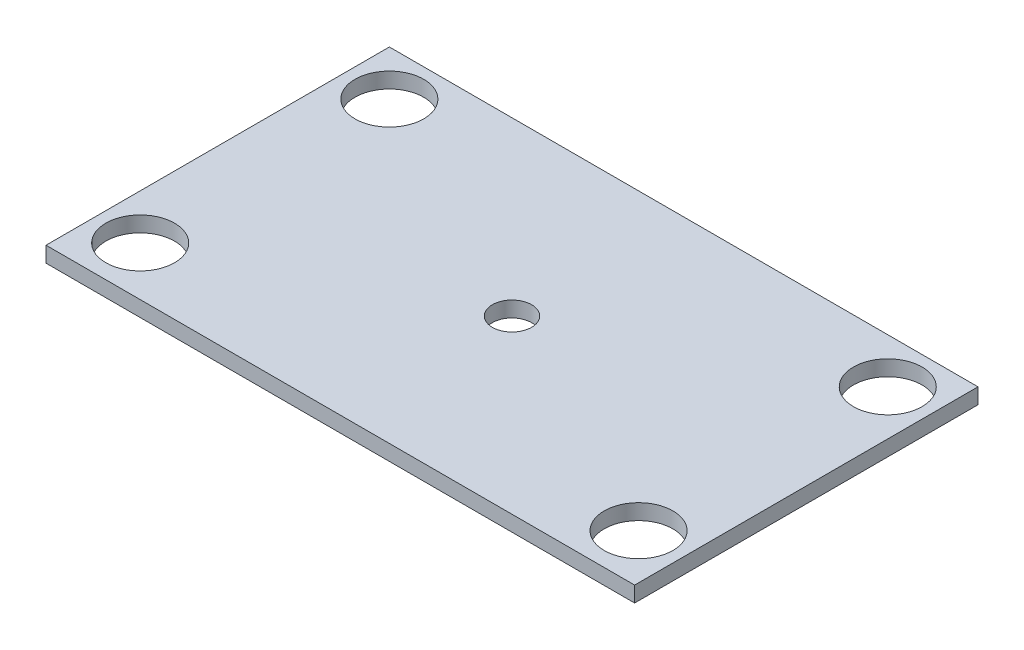
ISO-10303-21;
HEADER;
FILE_DESCRIPTION(('STEP AP214'),'2;1');
FILE_NAME('part.step','',(''),(''),'','','');
FILE_SCHEMA(('AUTOMOTIVE_DESIGN { 1 0 10303 214 1 1 1 1 }'));
ENDSEC;
DATA;
#1=APPLICATION_CONTEXT('core data for automotive mechanical design processes');
#2=APPLICATION_PROTOCOL_DEFINITION('international standard','automotive_design',2000,#1);
#3=PRODUCT_CONTEXT('',#1,'mechanical');
#4=PRODUCT('Part','Part','',(#3));
#5=PRODUCT_RELATED_PRODUCT_CATEGORY('part','',(#4));
#6=PRODUCT_DEFINITION_FORMATION('','',#4);
#7=PRODUCT_DEFINITION_CONTEXT('part definition',#1,'design');
#8=PRODUCT_DEFINITION('design','',#6,#7);
#9=PRODUCT_DEFINITION_SHAPE('','',#8);
#10=(LENGTH_UNIT() NAMED_UNIT(*) SI_UNIT(.MILLI.,.METRE.));
#11=(NAMED_UNIT(*) PLANE_ANGLE_UNIT() SI_UNIT($,.RADIAN.));
#12=(NAMED_UNIT(*) SI_UNIT($,.STERADIAN.) SOLID_ANGLE_UNIT());
#13=UNCERTAINTY_MEASURE_WITH_UNIT(LENGTH_MEASURE(1.E-05),#10,'distance_accuracy_value','');
#14=(GEOMETRIC_REPRESENTATION_CONTEXT(3) GLOBAL_UNCERTAINTY_ASSIGNED_CONTEXT((#13)) GLOBAL_UNIT_ASSIGNED_CONTEXT((#10,
#11,#12)) REPRESENTATION_CONTEXT('',''));
#15=CARTESIAN_POINT('',(0.,0.,0.));
#16=DIRECTION('',(0.,0.,1.));
#17=DIRECTION('',(1.,0.,0.));
#18=AXIS2_PLACEMENT_3D('',#15,#16,#17);
#19=CARTESIAN_POINT('',(0.,1.5875,0.));
#20=DIRECTION('',(0.,-1.,0.));
#21=DIRECTION('',(0.,0.,-1.));
#22=AXIS2_PLACEMENT_3D('',#19,#20,#21);
#23=PLANE('',#22);
#24=DIRECTION('',(0.,0.,1.));
#25=VECTOR('',#24,1.);
#26=CARTESIAN_POINT('',(0.,1.5875,0.));
#27=LINE('',#26,#25);
#28=CARTESIAN_POINT('',(0.,1.5875,-35.));
#29=VERTEX_POINT('',#28);
#30=CARTESIAN_POINT('',(0.,1.5875,0.));
#31=VERTEX_POINT('',#30);
#32=EDGE_CURVE('E96',#29,#31,#27,.T.);
#33=ORIENTED_EDGE('',*,*,#32,.T.);
#34=DIRECTION('',(1.,0.,0.));
#35=VECTOR('',#34,1.);
#36=CARTESIAN_POINT('',(0.,1.5875,0.));
#37=LINE('',#36,#35);
#38=CARTESIAN_POINT('',(60.,1.5875,0.));
#39=VERTEX_POINT('',#38);
#40=EDGE_CURVE('E91',#31,#39,#37,.T.);
#41=ORIENTED_EDGE('',*,*,#40,.T.);
#42=DIRECTION('',(0.,0.,-1.));
#43=VECTOR('',#42,1.);
#44=CARTESIAN_POINT('',(60.,1.5875,0.));
#45=LINE('',#44,#43);
#46=CARTESIAN_POINT('',(60.,1.5875,-35.));
#47=VERTEX_POINT('',#46);
#48=EDGE_CURVE('E94',#39,#47,#45,.T.);
#49=ORIENTED_EDGE('',*,*,#48,.T.);
#50=DIRECTION('',(-1.,0.,0.));
#51=VECTOR('',#50,1.);
#52=CARTESIAN_POINT('',(0.,1.5875,-35.));
#53=LINE('',#52,#51);
#54=EDGE_CURVE('E61',#47,#29,#53,.T.);
#55=ORIENTED_EDGE('',*,*,#54,.T.);
#56=EDGE_LOOP('',(#33,#41,#49,#55));
#57=FACE_BOUND('',#56,.T.);
#58=CARTESIAN_POINT('',(4.6,1.5875,-30.4));
#59=DIRECTION('',(0.,1.,0.));
#60=DIRECTION('',(0.,0.,1.));
#61=AXIS2_PLACEMENT_3D('',#58,#59,#60);
#62=CIRCLE('',#61,3.5);
#63=CARTESIAN_POINT('',(4.6,1.5875,-26.9));
#64=VERTEX_POINT('',#63);
#65=EDGE_CURVE('E116',#64,#64,#62,.T.);
#66=ORIENTED_EDGE('',*,*,#65,.F.);
#67=EDGE_LOOP('',(#66));
#68=FACE_BOUND('',#67,.T.);
#69=CARTESIAN_POINT('',(55.4,1.5875,-30.4));
#70=DIRECTION('',(0.,1.,0.));
#71=DIRECTION('',(0.,0.,1.));
#72=AXIS2_PLACEMENT_3D('',#69,#70,#71);
#73=CIRCLE('',#72,3.5);
#74=CARTESIAN_POINT('',(55.4,1.5875,-26.9));
#75=VERTEX_POINT('',#74);
#76=EDGE_CURVE('E138',#75,#75,#73,.T.);
#77=ORIENTED_EDGE('',*,*,#76,.F.);
#78=EDGE_LOOP('',(#77));
#79=FACE_BOUND('',#78,.T.);
#80=CARTESIAN_POINT('',(4.6,1.5875,-5.));
#81=DIRECTION('',(0.,1.,0.));
#82=DIRECTION('',(0.,0.,1.));
#83=AXIS2_PLACEMENT_3D('',#80,#81,#82);
#84=CIRCLE('',#83,3.5);
#85=CARTESIAN_POINT('',(4.6,1.5875,-1.5));
#86=VERTEX_POINT('',#85);
#87=EDGE_CURVE('E146',#86,#86,#84,.T.);
#88=ORIENTED_EDGE('',*,*,#87,.F.);
#89=EDGE_LOOP('',(#88));
#90=FACE_BOUND('',#89,.T.);
#91=CARTESIAN_POINT('',(55.4,1.5875,-5.));
#92=DIRECTION('',(0.,1.,0.));
#93=DIRECTION('',(0.,0.,1.));
#94=AXIS2_PLACEMENT_3D('',#91,#92,#93);
#95=CIRCLE('',#94,3.5);
#96=CARTESIAN_POINT('',(55.4,1.5875,-1.5));
#97=VERTEX_POINT('',#96);
#98=EDGE_CURVE('E154',#97,#97,#95,.T.);
#99=ORIENTED_EDGE('',*,*,#98,.F.);
#100=EDGE_LOOP('',(#99));
#101=FACE_BOUND('',#100,.T.);
#102=CARTESIAN_POINT('',(30.,1.5875,-17.5));
#103=DIRECTION('',(0.,1.,0.));
#104=DIRECTION('',(0.,0.,1.));
#105=AXIS2_PLACEMENT_3D('',#102,#103,#104);
#106=CIRCLE('',#105,2.);
#107=CARTESIAN_POINT('',(30.,1.5875,-15.5));
#108=VERTEX_POINT('',#107);
#109=EDGE_CURVE('E162',#108,#108,#106,.T.);
#110=ORIENTED_EDGE('',*,*,#109,.F.);
#111=EDGE_LOOP('',(#110));
#112=FACE_BOUND('',#111,.T.);
#113=ADVANCED_FACE('F43',(#57,#68,#79,#90,#101,#112),#23,.F.);
#114=CARTESIAN_POINT('',(0.,0.,0.));
#115=DIRECTION('',(0.,-1.,0.));
#116=DIRECTION('',(0.,0.,-1.));
#117=AXIS2_PLACEMENT_3D('',#114,#115,#116);
#118=PLANE('',#117);
#119=CARTESIAN_POINT('',(55.4,0.,-5.));
#120=DIRECTION('',(0.,1.,0.));
#121=DIRECTION('',(0.,0.,1.));
#122=AXIS2_PLACEMENT_3D('',#119,#120,#121);
#123=CIRCLE('',#122,3.5);
#124=CARTESIAN_POINT('',(55.4,0.,-1.5));
#125=VERTEX_POINT('',#124);
#126=EDGE_CURVE('E158',#125,#125,#123,.T.);
#127=ORIENTED_EDGE('',*,*,#126,.T.);
#128=EDGE_LOOP('',(#127));
#129=FACE_BOUND('',#128,.T.);
#130=CARTESIAN_POINT('',(55.4,0.,-30.4));
#131=DIRECTION('',(0.,1.,0.));
#132=DIRECTION('',(0.,0.,1.));
#133=AXIS2_PLACEMENT_3D('',#130,#131,#132);
#134=CIRCLE('',#133,3.5);
#135=CARTESIAN_POINT('',(55.4,0.,-26.9));
#136=VERTEX_POINT('',#135);
#137=EDGE_CURVE('E142',#136,#136,#134,.T.);
#138=ORIENTED_EDGE('',*,*,#137,.T.);
#139=EDGE_LOOP('',(#138));
#140=FACE_BOUND('',#139,.T.);
#141=DIRECTION('',(0.,0.,1.));
#142=VECTOR('',#141,1.);
#143=CARTESIAN_POINT('',(0.,0.,0.));
#144=LINE('',#143,#142);
#145=CARTESIAN_POINT('',(0.,0.,-35.));
#146=VERTEX_POINT('',#145);
#147=CARTESIAN_POINT('',(0.,0.,0.));
#148=VERTEX_POINT('',#147);
#149=EDGE_CURVE('E112',#146,#148,#144,.T.);
#150=ORIENTED_EDGE('',*,*,#149,.F.);
#151=DIRECTION('',(-1.,0.,0.));
#152=VECTOR('',#151,1.);
#153=CARTESIAN_POINT('',(0.,0.,-35.));
#154=LINE('',#153,#152);
#155=CARTESIAN_POINT('',(60.,0.,-35.));
#156=VERTEX_POINT('',#155);
#157=EDGE_CURVE('E84',#156,#146,#154,.T.);
#158=ORIENTED_EDGE('',*,*,#157,.F.);
#159=DIRECTION('',(0.,0.,-1.));
#160=VECTOR('',#159,1.);
#161=CARTESIAN_POINT('',(60.,0.,0.));
#162=LINE('',#161,#160);
#163=CARTESIAN_POINT('',(60.,0.,0.));
#164=VERTEX_POINT('',#163);
#165=EDGE_CURVE('E78',#164,#156,#162,.T.);
#166=ORIENTED_EDGE('',*,*,#165,.F.);
#167=DIRECTION('',(1.,0.,0.));
#168=VECTOR('',#167,1.);
#169=CARTESIAN_POINT('',(0.,0.,0.));
#170=LINE('',#169,#168);
#171=EDGE_CURVE('E101',#148,#164,#170,.T.);
#172=ORIENTED_EDGE('',*,*,#171,.F.);
#173=EDGE_LOOP('',(#150,#158,#166,#172));
#174=FACE_BOUND('',#173,.T.);
#175=CARTESIAN_POINT('',(4.6,0.,-30.4));
#176=DIRECTION('',(0.,1.,0.));
#177=DIRECTION('',(0.,0.,1.));
#178=AXIS2_PLACEMENT_3D('',#175,#176,#177);
#179=CIRCLE('',#178,3.5);
#180=CARTESIAN_POINT('',(4.6,0.,-26.9));
#181=VERTEX_POINT('',#180);
#182=EDGE_CURVE('E134',#181,#181,#179,.T.);
#183=ORIENTED_EDGE('',*,*,#182,.T.);
#184=EDGE_LOOP('',(#183));
#185=FACE_BOUND('',#184,.T.);
#186=CARTESIAN_POINT('',(4.6,0.,-5.));
#187=DIRECTION('',(0.,1.,0.));
#188=DIRECTION('',(0.,0.,1.));
#189=AXIS2_PLACEMENT_3D('',#186,#187,#188);
#190=CIRCLE('',#189,3.5);
#191=CARTESIAN_POINT('',(4.6,0.,-1.5));
#192=VERTEX_POINT('',#191);
#193=EDGE_CURVE('E150',#192,#192,#190,.T.);
#194=ORIENTED_EDGE('',*,*,#193,.T.);
#195=EDGE_LOOP('',(#194));
#196=FACE_BOUND('',#195,.T.);
#197=CARTESIAN_POINT('',(30.,0.,-17.5));
#198=DIRECTION('',(0.,1.,0.));
#199=DIRECTION('',(0.,0.,1.));
#200=AXIS2_PLACEMENT_3D('',#197,#198,#199);
#201=CIRCLE('',#200,2.);
#202=CARTESIAN_POINT('',(30.,0.,-15.5));
#203=VERTEX_POINT('',#202);
#204=EDGE_CURVE('E166',#203,#203,#201,.T.);
#205=ORIENTED_EDGE('',*,*,#204,.T.);
#206=EDGE_LOOP('',(#205));
#207=FACE_BOUND('',#206,.T.);
#208=ADVANCED_FACE('F129',(#129,#140,#174,#185,#196,#207),#118,.T.);
#209=CARTESIAN_POINT('',(0.,1.5875,0.));
#210=DIRECTION('',(1.,0.,0.));
#211=DIRECTION('',(0.,0.,-1.));
#212=AXIS2_PLACEMENT_3D('',#209,#210,#211);
#213=PLANE('',#212);
#214=ORIENTED_EDGE('',*,*,#149,.T.);
#215=DIRECTION('',(0.,-1.,0.));
#216=VECTOR('',#215,1.);
#217=CARTESIAN_POINT('',(0.,1.5875,0.));
#218=LINE('',#217,#216);
#219=EDGE_CURVE('E11',#31,#148,#218,.T.);
#220=ORIENTED_EDGE('',*,*,#219,.F.);
#221=ORIENTED_EDGE('',*,*,#32,.F.);
#222=DIRECTION('',(0.,-1.,0.));
#223=VECTOR('',#222,1.);
#224=CARTESIAN_POINT('',(0.,1.5875,-35.));
#225=LINE('',#224,#223);
#226=EDGE_CURVE('E108',#29,#146,#225,.T.);
#227=ORIENTED_EDGE('',*,*,#226,.T.);
#228=EDGE_LOOP('',(#214,#220,#221,#227));
#229=FACE_BOUND('',#228,.T.);
#230=ADVANCED_FACE('F45',(#229),#213,.F.);
#231=CARTESIAN_POINT('',(0.,1.5875,0.));
#232=DIRECTION('',(0.,0.,-1.));
#233=DIRECTION('',(-1.,0.,0.));
#234=AXIS2_PLACEMENT_3D('',#231,#232,#233);
#235=PLANE('',#234);
#236=ORIENTED_EDGE('',*,*,#171,.T.);
#237=DIRECTION('',(0.,-1.,0.));
#238=VECTOR('',#237,1.);
#239=CARTESIAN_POINT('',(60.,1.5875,0.));
#240=LINE('',#239,#238);
#241=EDGE_CURVE('E53',#39,#164,#240,.T.);
#242=ORIENTED_EDGE('',*,*,#241,.F.);
#243=ORIENTED_EDGE('',*,*,#40,.F.);
#244=ORIENTED_EDGE('',*,*,#219,.T.);
#245=EDGE_LOOP('',(#236,#242,#243,#244));
#246=FACE_BOUND('',#245,.T.);
#247=ADVANCED_FACE('F100',(#246),#235,.F.);
#248=CARTESIAN_POINT('',(60.,1.5875,0.));
#249=DIRECTION('',(-1.,0.,0.));
#250=DIRECTION('',(0.,0.,1.));
#251=AXIS2_PLACEMENT_3D('',#248,#249,#250);
#252=PLANE('',#251);
#253=ORIENTED_EDGE('',*,*,#165,.T.);
#254=DIRECTION('',(0.,-1.,0.));
#255=VECTOR('',#254,1.);
#256=CARTESIAN_POINT('',(60.,1.5875,-35.));
#257=LINE('',#256,#255);
#258=EDGE_CURVE('E103',#47,#156,#257,.T.);
#259=ORIENTED_EDGE('',*,*,#258,.F.);
#260=ORIENTED_EDGE('',*,*,#48,.F.);
#261=ORIENTED_EDGE('',*,*,#241,.T.);
#262=EDGE_LOOP('',(#253,#259,#260,#261));
#263=FACE_BOUND('',#262,.T.);
#264=ADVANCED_FACE('F104',(#263),#252,.F.);
#265=CARTESIAN_POINT('',(0.,1.5875,-35.));
#266=DIRECTION('',(0.,0.,1.));
#267=DIRECTION('',(1.,0.,0.));
#268=AXIS2_PLACEMENT_3D('',#265,#266,#267);
#269=PLANE('',#268);
#270=ORIENTED_EDGE('',*,*,#157,.T.);
#271=ORIENTED_EDGE('',*,*,#226,.F.);
#272=ORIENTED_EDGE('',*,*,#54,.F.);
#273=ORIENTED_EDGE('',*,*,#258,.T.);
#274=EDGE_LOOP('',(#270,#271,#272,#273));
#275=FACE_BOUND('',#274,.T.);
#276=ADVANCED_FACE('F126',(#275),#269,.F.);
#277=CARTESIAN_POINT('',(4.6,1.5875,-30.4));
#278=DIRECTION('',(0.,-1.,0.));
#279=DIRECTION('',(0.,0.,-1.));
#280=AXIS2_PLACEMENT_3D('',#277,#278,#279);
#281=CYLINDRICAL_SURFACE('',#280,3.5);
#282=ORIENTED_EDGE('',*,*,#65,.T.);
#283=EDGE_LOOP('',(#282));
#284=FACE_BOUND('',#283,.T.);
#285=ORIENTED_EDGE('',*,*,#182,.F.);
#286=EDGE_LOOP('',(#285));
#287=FACE_BOUND('',#286,.T.);
#288=ADVANCED_FACE('F185',(#284,#287),#281,.F.);
#289=CARTESIAN_POINT('',(55.4,1.5875,-30.4));
#290=DIRECTION('',(0.,-1.,0.));
#291=DIRECTION('',(0.,0.,-1.));
#292=AXIS2_PLACEMENT_3D('',#289,#290,#291);
#293=CYLINDRICAL_SURFACE('',#292,3.5);
#294=ORIENTED_EDGE('',*,*,#76,.T.);
#295=EDGE_LOOP('',(#294));
#296=FACE_BOUND('',#295,.T.);
#297=ORIENTED_EDGE('',*,*,#137,.F.);
#298=EDGE_LOOP('',(#297));
#299=FACE_BOUND('',#298,.T.);
#300=ADVANCED_FACE('F239',(#296,#299),#293,.F.);
#301=CARTESIAN_POINT('',(4.6,1.5875,-5.));
#302=DIRECTION('',(0.,-1.,0.));
#303=DIRECTION('',(0.,0.,-1.));
#304=AXIS2_PLACEMENT_3D('',#301,#302,#303);
#305=CYLINDRICAL_SURFACE('',#304,3.5);
#306=ORIENTED_EDGE('',*,*,#87,.T.);
#307=EDGE_LOOP('',(#306));
#308=FACE_BOUND('',#307,.T.);
#309=ORIENTED_EDGE('',*,*,#193,.F.);
#310=EDGE_LOOP('',(#309));
#311=FACE_BOUND('',#310,.T.);
#312=ADVANCED_FACE('F248',(#308,#311),#305,.F.);
#313=CARTESIAN_POINT('',(55.4,1.5875,-5.));
#314=DIRECTION('',(0.,-1.,0.));
#315=DIRECTION('',(0.,0.,-1.));
#316=AXIS2_PLACEMENT_3D('',#313,#314,#315);
#317=CYLINDRICAL_SURFACE('',#316,3.5);
#318=ORIENTED_EDGE('',*,*,#98,.T.);
#319=EDGE_LOOP('',(#318));
#320=FACE_BOUND('',#319,.T.);
#321=ORIENTED_EDGE('',*,*,#126,.F.);
#322=EDGE_LOOP('',(#321));
#323=FACE_BOUND('',#322,.T.);
#324=ADVANCED_FACE('F257',(#320,#323),#317,.F.);
#325=CARTESIAN_POINT('',(30.,1.5875,-17.5));
#326=DIRECTION('',(0.,-1.,0.));
#327=DIRECTION('',(0.,0.,-1.));
#328=AXIS2_PLACEMENT_3D('',#325,#326,#327);
#329=CYLINDRICAL_SURFACE('',#328,2.);
#330=ORIENTED_EDGE('',*,*,#109,.T.);
#331=EDGE_LOOP('',(#330));
#332=FACE_BOUND('',#331,.T.);
#333=ORIENTED_EDGE('',*,*,#204,.F.);
#334=EDGE_LOOP('',(#333));
#335=FACE_BOUND('',#334,.T.);
#336=ADVANCED_FACE('F174',(#332,#335),#329,.F.);
#337=CLOSED_SHELL('',(#113,#208,#230,#247,#264,#276,#288,#300,#312,#324,#336));
#338=MANIFOLD_SOLID_BREP('B2',#337);
#339=ADVANCED_BREP_SHAPE_REPRESENTATION('',(#18,#338),#14);
#340=SHAPE_DEFINITION_REPRESENTATION(#9,#339);
ENDSEC;
END-ISO-10303-21;
